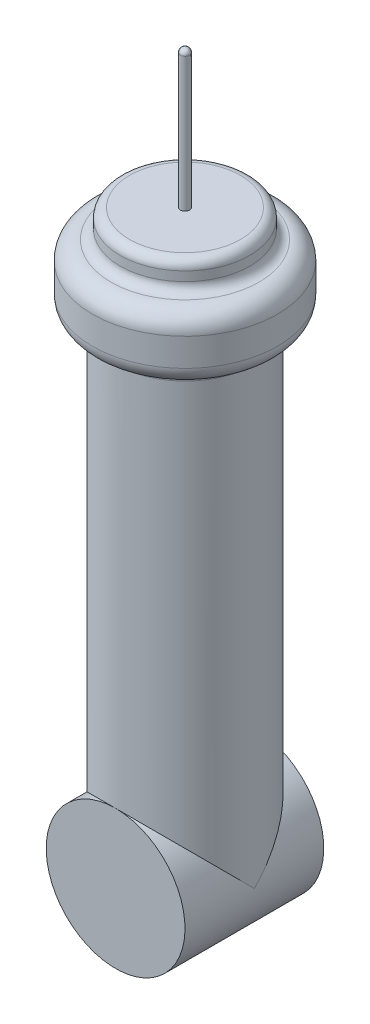
ISO-10303-21;
HEADER;
FILE_DESCRIPTION(('STEP AP214'),'2;1');
FILE_NAME('part.step','',(''),(''),'','','');
FILE_SCHEMA(('AUTOMOTIVE_DESIGN { 1 0 10303 214 1 1 1 1 }'));
ENDSEC;
DATA;
#1=APPLICATION_CONTEXT('core data for automotive mechanical design processes');
#2=APPLICATION_PROTOCOL_DEFINITION('international standard','automotive_design',2000,#1);
#3=PRODUCT_CONTEXT('',#1,'mechanical');
#4=PRODUCT('Part','Part','',(#3));
#5=PRODUCT_RELATED_PRODUCT_CATEGORY('part','',(#4));
#6=PRODUCT_DEFINITION_FORMATION('','',#4);
#7=PRODUCT_DEFINITION_CONTEXT('part definition',#1,'design');
#8=PRODUCT_DEFINITION('design','',#6,#7);
#9=PRODUCT_DEFINITION_SHAPE('','',#8);
#10=(LENGTH_UNIT() NAMED_UNIT(*) SI_UNIT(.MILLI.,.METRE.));
#11=(NAMED_UNIT(*) PLANE_ANGLE_UNIT() SI_UNIT($,.RADIAN.));
#12=(NAMED_UNIT(*) SI_UNIT($,.STERADIAN.) SOLID_ANGLE_UNIT());
#13=UNCERTAINTY_MEASURE_WITH_UNIT(LENGTH_MEASURE(1.E-05),#10,'distance_accuracy_value','');
#14=(GEOMETRIC_REPRESENTATION_CONTEXT(3) GLOBAL_UNCERTAINTY_ASSIGNED_CONTEXT((#13)) GLOBAL_UNIT_ASSIGNED_CONTEXT((#10,
#11,#12)) REPRESENTATION_CONTEXT('',''));
#15=CARTESIAN_POINT('',(0.,0.,0.));
#16=DIRECTION('',(0.,0.,1.));
#17=DIRECTION('',(1.,0.,0.));
#18=AXIS2_PLACEMENT_3D('',#15,#16,#17);
#19=CARTESIAN_POINT('',(0.,0.,30.));
#20=DIRECTION('',(0.,0.,-1.));
#21=DIRECTION('',(-1.,0.,0.));
#22=AXIS2_PLACEMENT_3D('',#19,#20,#21);
#23=CYLINDRICAL_SURFACE('',#22,15.);
#24=CARTESIAN_POINT('',(0.,0.,15.));
#25=DIRECTION('',(0.,-0.707106781186547,-0.707106781186547));
#26=DIRECTION('',(0.,0.707106781186547,-0.707106781186547));
#27=AXIS2_PLACEMENT_3D('',#24,#25,#26);
#28=ELLIPSE('',#27,21.2132034355964,15.);
#29=CARTESIAN_POINT('',(15.,0.,15.));
#30=VERTEX_POINT('',#29);
#31=CARTESIAN_POINT('',(0.,15.,0.));
#32=VERTEX_POINT('',#31);
#33=EDGE_CURVE('E67',#30,#32,#28,.F.);
#34=ORIENTED_EDGE('',*,*,#33,.F.);
#35=CARTESIAN_POINT('',(0.,0.,15.));
#36=DIRECTION('',(0.,0.707106781186547,-0.707106781186547));
#37=DIRECTION('',(0.,-0.707106781186547,-0.707106781186547));
#38=AXIS2_PLACEMENT_3D('',#35,#36,#37);
#39=ELLIPSE('',#38,21.2132034355964,15.);
#40=CARTESIAN_POINT('',(0.,15.,30.));
#41=VERTEX_POINT('',#40);
#42=EDGE_CURVE('E60',#41,#30,#39,.T.);
#43=ORIENTED_EDGE('',*,*,#42,.F.);
#44=CARTESIAN_POINT('',(0.,0.,30.));
#45=DIRECTION('',(0.,0.,1.));
#46=DIRECTION('',(1.,0.,0.));
#47=AXIS2_PLACEMENT_3D('',#44,#45,#46);
#48=CIRCLE('',#47,15.);
#49=EDGE_CURVE('E77',#41,#41,#48,.T.);
#50=ORIENTED_EDGE('',*,*,#49,.F.);
#51=CARTESIAN_POINT('',(-15.,0.,15.));
#52=VERTEX_POINT('',#51);
#53=EDGE_CURVE('E54',#52,#41,#39,.T.);
#54=ORIENTED_EDGE('',*,*,#53,.F.);
#55=EDGE_CURVE('E72',#32,#52,#28,.F.);
#56=ORIENTED_EDGE('',*,*,#55,.F.);
#57=CARTESIAN_POINT('',(0.,0.,0.));
#58=DIRECTION('',(0.,0.,1.));
#59=DIRECTION('',(1.,0.,0.));
#60=AXIS2_PLACEMENT_3D('',#57,#58,#59);
#61=CIRCLE('',#60,15.);
#62=EDGE_CURVE('E69',#32,#32,#61,.T.);
#63=ORIENTED_EDGE('',*,*,#62,.T.);
#64=EDGE_LOOP('',(#34,#43,#50,#54,#56,#63));
#65=FACE_BOUND('',#64,.T.);
#66=ADVANCED_FACE('F39',(#65),#23,.T.);
#67=CARTESIAN_POINT('',(0.,0.,30.));
#68=DIRECTION('',(0.,0.,1.));
#69=DIRECTION('',(1.,0.,0.));
#70=AXIS2_PLACEMENT_3D('',#67,#68,#69);
#71=PLANE('',#70);
#72=ORIENTED_EDGE('',*,*,#49,.T.);
#73=EDGE_LOOP('',(#72));
#74=FACE_BOUND('',#73,.T.);
#75=ADVANCED_FACE('F134',(#74),#71,.T.);
#76=CARTESIAN_POINT('',(0.,0.,0.));
#77=DIRECTION('',(0.,0.,1.));
#78=DIRECTION('',(1.,0.,0.));
#79=AXIS2_PLACEMENT_3D('',#76,#77,#78);
#80=PLANE('',#79);
#81=ORIENTED_EDGE('',*,*,#62,.F.);
#82=EDGE_LOOP('',(#81));
#83=FACE_BOUND('',#82,.T.);
#84=ADVANCED_FACE('F139',(#83),#80,.F.);
#85=CARTESIAN_POINT('',(0.,100.,15.));
#86=DIRECTION('',(0.,-1.,0.));
#87=DIRECTION('',(0.,0.,-1.));
#88=AXIS2_PLACEMENT_3D('',#85,#86,#87);
#89=CYLINDRICAL_SURFACE('',#88,15.);
#90=CARTESIAN_POINT('',(0.,98.0839202169004,15.));
#91=DIRECTION('',(0.,1.,0.));
#92=DIRECTION('',(0.,0.,1.));
#93=AXIS2_PLACEMENT_3D('',#90,#91,#92);
#94=CIRCLE('',#93,15.);
#95=CARTESIAN_POINT('',(0.,98.0839202169004,30.));
#96=VERTEX_POINT('',#95);
#97=EDGE_CURVE('E92',#96,#96,#94,.F.);
#98=ORIENTED_EDGE('',*,*,#97,.T.);
#99=EDGE_LOOP('',(#98));
#100=FACE_BOUND('',#99,.T.);
#101=ORIENTED_EDGE('',*,*,#42,.T.);
#102=ORIENTED_EDGE('',*,*,#33,.T.);
#103=ORIENTED_EDGE('',*,*,#55,.T.);
#104=ORIENTED_EDGE('',*,*,#53,.T.);
#105=EDGE_LOOP('',(#101,#102,#103,#104));
#106=FACE_BOUND('',#105,.T.);
#107=ADVANCED_FACE('F73',(#100,#106),#89,.T.);
#108=CARTESIAN_POINT('',(0.,114.,15.));
#109=DIRECTION('',(0.,-1.,0.));
#110=DIRECTION('',(0.,0.,-1.));
#111=AXIS2_PLACEMENT_3D('',#108,#109,#110);
#112=CYLINDRICAL_SURFACE('',#111,20.);
#113=CARTESIAN_POINT('',(0.,110.,15.));
#114=DIRECTION('',(0.,1.,0.));
#115=DIRECTION('',(0.,0.,1.));
#116=AXIS2_PLACEMENT_3D('',#113,#114,#115);
#117=CIRCLE('',#116,20.);
#118=CARTESIAN_POINT('',(0.,110.,35.));
#119=VERTEX_POINT('',#118);
#120=EDGE_CURVE('E86',#119,#119,#117,.F.);
#121=ORIENTED_EDGE('',*,*,#120,.T.);
#122=EDGE_LOOP('',(#121));
#123=FACE_BOUND('',#122,.T.);
#124=CARTESIAN_POINT('',(0.,104.,15.));
#125=DIRECTION('',(0.,1.,0.));
#126=DIRECTION('',(0.,0.,1.));
#127=AXIS2_PLACEMENT_3D('',#124,#125,#126);
#128=CIRCLE('',#127,20.);
#129=CARTESIAN_POINT('',(0.,104.,35.));
#130=VERTEX_POINT('',#129);
#131=EDGE_CURVE('E83',#130,#130,#128,.T.);
#132=ORIENTED_EDGE('',*,*,#131,.T.);
#133=EDGE_LOOP('',(#132));
#134=FACE_BOUND('',#133,.T.);
#135=ADVANCED_FACE('F159',(#123,#134),#112,.T.);
#136=CARTESIAN_POINT('',(0.,120.,15.));
#137=DIRECTION('',(0.,-1.,0.));
#138=DIRECTION('',(0.,0.,-1.));
#139=AXIS2_PLACEMENT_3D('',#136,#137,#138);
#140=CYLINDRICAL_SURFACE('',#139,14.);
#141=CARTESIAN_POINT('',(0.,118.,15.));
#142=DIRECTION('',(0.,1.,0.));
#143=DIRECTION('',(0.,0.,1.));
#144=AXIS2_PLACEMENT_3D('',#141,#142,#143);
#145=CIRCLE('',#144,14.);
#146=CARTESIAN_POINT('',(0.,118.,29.));
#147=VERTEX_POINT('',#146);
#148=EDGE_CURVE('E47',#147,#147,#145,.F.);
#149=ORIENTED_EDGE('',*,*,#148,.T.);
#150=EDGE_LOOP('',(#149));
#151=FACE_BOUND('',#150,.T.);
#152=CARTESIAN_POINT('',(0.,116.,15.));
#153=DIRECTION('',(0.,1.,0.));
#154=DIRECTION('',(0.,0.,1.));
#155=AXIS2_PLACEMENT_3D('',#152,#153,#154);
#156=CIRCLE('',#155,14.);
#157=CARTESIAN_POINT('',(0.,116.,29.));
#158=VERTEX_POINT('',#157);
#159=EDGE_CURVE('E98',#158,#158,#156,.T.);
#160=ORIENTED_EDGE('',*,*,#159,.T.);
#161=EDGE_LOOP('',(#160));
#162=FACE_BOUND('',#161,.T.);
#163=ADVANCED_FACE('F103',(#151,#162),#140,.T.);
#164=CARTESIAN_POINT('',(0.,120.,15.));
#165=DIRECTION('',(0.,1.,0.));
#166=DIRECTION('',(0.,0.,1.));
#167=AXIS2_PLACEMENT_3D('',#164,#165,#166);
#168=PLANE('',#167);
#169=CARTESIAN_POINT('',(0.,120.,15.));
#170=DIRECTION('',(0.,1.,0.));
#171=DIRECTION('',(0.,0.,1.));
#172=AXIS2_PLACEMENT_3D('',#169,#170,#171);
#173=CIRCLE('',#172,12.);
#174=CARTESIAN_POINT('',(0.,120.,27.));
#175=VERTEX_POINT('',#174);
#176=EDGE_CURVE('E95',#175,#175,#173,.T.);
#177=ORIENTED_EDGE('',*,*,#176,.T.);
#178=EDGE_LOOP('',(#177));
#179=FACE_BOUND('',#178,.T.);
#180=CARTESIAN_POINT('',(0.,120.,15.));
#181=DIRECTION('',(0.,1.,0.));
#182=DIRECTION('',(0.,0.,1.));
#183=AXIS2_PLACEMENT_3D('',#180,#181,#182);
#184=CIRCLE('',#183,1.);
#185=CARTESIAN_POINT('',(0.,120.,16.));
#186=VERTEX_POINT('',#185);
#187=EDGE_CURVE('E121',#186,#186,#184,.T.);
#188=ORIENTED_EDGE('',*,*,#187,.F.);
#189=EDGE_LOOP('',(#188));
#190=FACE_BOUND('',#189,.T.);
#191=ADVANCED_FACE('F114',(#179,#190),#168,.T.);
#192=CARTESIAN_POINT('',(0.,150.,15.));
#193=DIRECTION('',(0.,-1.,0.));
#194=DIRECTION('',(0.,0.,-1.));
#195=AXIS2_PLACEMENT_3D('',#192,#193,#194);
#196=CYLINDRICAL_SURFACE('',#195,1.);
#197=CARTESIAN_POINT('',(0.,149.,15.));
#198=DIRECTION('',(0.,-1.,0.));
#199=DIRECTION('',(0.,0.,-1.));
#200=AXIS2_PLACEMENT_3D('',#197,#198,#199);
#201=CIRCLE('',#200,1.);
#202=CARTESIAN_POINT('',(0.,149.,14.));
#203=VERTEX_POINT('',#202);
#204=EDGE_CURVE('E11',#203,#203,#201,.T.);
#205=ORIENTED_EDGE('',*,*,#204,.T.);
#206=EDGE_LOOP('',(#205));
#207=FACE_BOUND('',#206,.T.);
#208=ORIENTED_EDGE('',*,*,#187,.T.);
#209=EDGE_LOOP('',(#208));
#210=FACE_BOUND('',#209,.T.);
#211=ADVANCED_FACE('F117',(#207,#210),#196,.T.);
#212=CARTESIAN_POINT('',(0.,110.,15.));
#213=DIRECTION('',(0.,1.,0.));
#214=DIRECTION('',(0.,0.,1.));
#215=AXIS2_PLACEMENT_3D('',#212,#213,#214);
#216=TOROIDAL_SURFACE('',#215,16.,4.);
#217=ORIENTED_EDGE('',*,*,#120,.F.);
#218=EDGE_LOOP('',(#217));
#219=FACE_BOUND('',#218,.T.);
#220=CARTESIAN_POINT('',(0.,114.,15.));
#221=DIRECTION('',(0.,1.,0.));
#222=DIRECTION('',(0.,0.,1.));
#223=AXIS2_PLACEMENT_3D('',#220,#221,#222);
#224=CIRCLE('',#223,16.);
#225=CARTESIAN_POINT('',(0.,114.,31.));
#226=VERTEX_POINT('',#225);
#227=EDGE_CURVE('E79',#226,#226,#224,.T.);
#228=ORIENTED_EDGE('',*,*,#227,.F.);
#229=EDGE_LOOP('',(#228));
#230=FACE_BOUND('',#229,.T.);
#231=ADVANCED_FACE('F124',(#219,#230),#216,.T.);
#232=CARTESIAN_POINT('',(0.,104.,15.));
#233=DIRECTION('',(0.,1.,0.));
#234=DIRECTION('',(0.,0.,1.));
#235=AXIS2_PLACEMENT_3D('',#232,#233,#234);
#236=TOROIDAL_SURFACE('',#235,16.,4.);
#237=CARTESIAN_POINT('',(0.,100.055946811267,15.));
#238=DIRECTION('',(0.,1.,0.));
#239=DIRECTION('',(0.,0.,1.));
#240=AXIS2_PLACEMENT_3D('',#237,#238,#239);
#241=CIRCLE('',#240,16.6666666666666);
#242=CARTESIAN_POINT('',(0.,100.055946811267,31.6666666666666));
#243=VERTEX_POINT('',#242);
#244=EDGE_CURVE('E89',#243,#243,#241,.T.);
#245=ORIENTED_EDGE('',*,*,#244,.T.);
#246=EDGE_LOOP('',(#245));
#247=FACE_BOUND('',#246,.T.);
#248=ORIENTED_EDGE('',*,*,#131,.F.);
#249=EDGE_LOOP('',(#248));
#250=FACE_BOUND('',#249,.T.);
#251=ADVANCED_FACE('F130',(#247,#250),#236,.T.);
#252=CARTESIAN_POINT('',(0.,98.0839202169004,15.));
#253=DIRECTION('',(0.,1.,0.));
#254=DIRECTION('',(0.,0.,1.));
#255=AXIS2_PLACEMENT_3D('',#252,#253,#254);
#256=TOROIDAL_SURFACE('',#255,17.,2.);
#257=ORIENTED_EDGE('',*,*,#97,.F.);
#258=EDGE_LOOP('',(#257));
#259=FACE_BOUND('',#258,.T.);
#260=ORIENTED_EDGE('',*,*,#244,.F.);
#261=EDGE_LOOP('',(#260));
#262=FACE_BOUND('',#261,.T.);
#263=ADVANCED_FACE('F110',(#259,#262),#256,.F.);
#264=CARTESIAN_POINT('',(0.,118.,15.));
#265=DIRECTION('',(0.,1.,0.));
#266=DIRECTION('',(0.,0.,1.));
#267=AXIS2_PLACEMENT_3D('',#264,#265,#266);
#268=TOROIDAL_SURFACE('',#267,12.,2.);
#269=ORIENTED_EDGE('',*,*,#148,.F.);
#270=EDGE_LOOP('',(#269));
#271=FACE_BOUND('',#270,.T.);
#272=ORIENTED_EDGE('',*,*,#176,.F.);
#273=EDGE_LOOP('',(#272));
#274=FACE_BOUND('',#273,.T.);
#275=ADVANCED_FACE('F106',(#271,#274),#268,.T.);
#276=CARTESIAN_POINT('',(0.,116.,15.));
#277=DIRECTION('',(0.,1.,0.));
#278=DIRECTION('',(0.,0.,1.));
#279=AXIS2_PLACEMENT_3D('',#276,#277,#278);
#280=TOROIDAL_SURFACE('',#279,16.,2.);
#281=ORIENTED_EDGE('',*,*,#227,.T.);
#282=EDGE_LOOP('',(#281));
#283=FACE_BOUND('',#282,.T.);
#284=ORIENTED_EDGE('',*,*,#159,.F.);
#285=EDGE_LOOP('',(#284));
#286=FACE_BOUND('',#285,.T.);
#287=ADVANCED_FACE('F109',(#283,#286),#280,.F.);
#288=CARTESIAN_POINT('',(0.,149.,15.));
#289=DIRECTION('',(0.,1.,0.));
#290=DIRECTION('',(0.,0.,1.));
#291=AXIS2_PLACEMENT_3D('',#288,#289,#290);
#292=SPHERICAL_SURFACE('',#291,1.);
#293=ORIENTED_EDGE('',*,*,#204,.F.);
#294=EDGE_LOOP('',(#293));
#295=FACE_BOUND('',#294,.T.);
#296=ADVANCED_FACE('F41',(#295),#292,.T.);
#297=CLOSED_SHELL('',(#66,#75,#84,#107,#135,#163,#191,#211,#231,#251,#263,#275,#287,#296));
#298=MANIFOLD_SOLID_BREP('B2',#297);
#299=ADVANCED_BREP_SHAPE_REPRESENTATION('',(#18,#298),#14);
#300=SHAPE_DEFINITION_REPRESENTATION(#9,#299);
ENDSEC;
END-ISO-10303-21;
